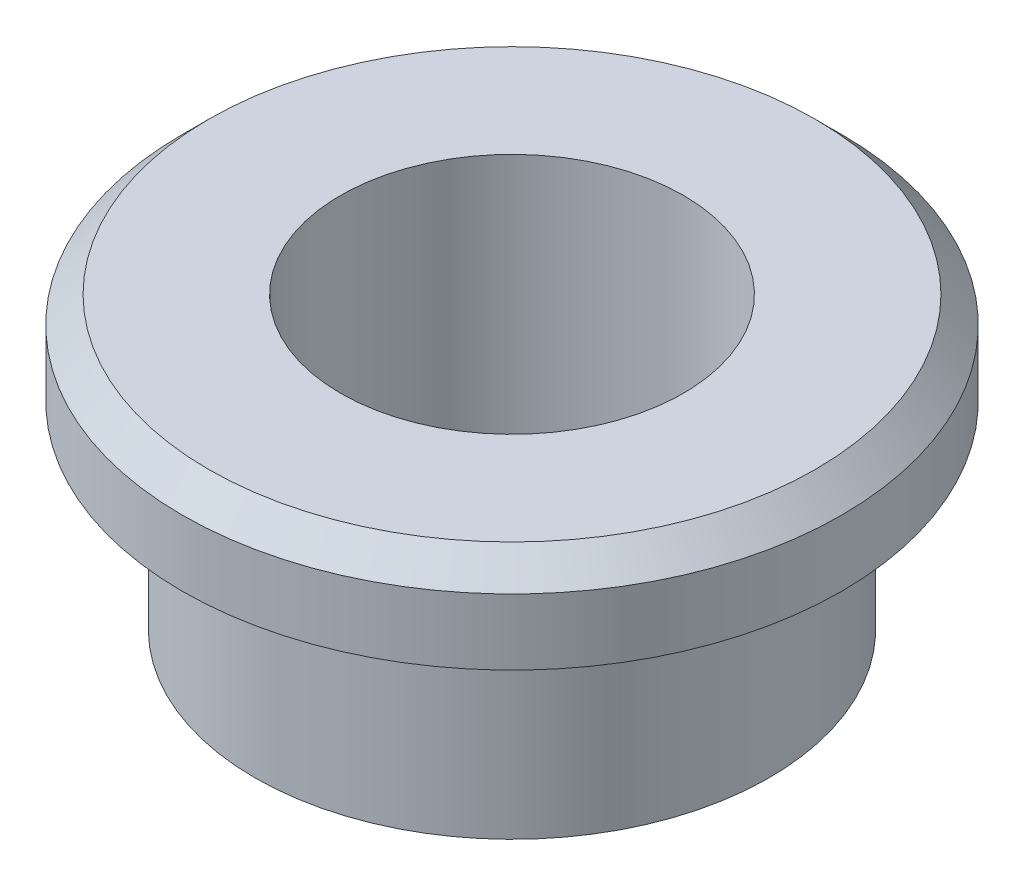
ISO-10303-21;
HEADER;
FILE_DESCRIPTION(('STEP AP214'),'2;1');
FILE_NAME('part.step','',(''),(''),'','','');
FILE_SCHEMA(('AUTOMOTIVE_DESIGN { 1 0 10303 214 1 1 1 1 }'));
ENDSEC;
DATA;
#1=APPLICATION_CONTEXT('core data for automotive mechanical design processes');
#2=APPLICATION_PROTOCOL_DEFINITION('international standard','automotive_design',2000,#1);
#3=PRODUCT_CONTEXT('',#1,'mechanical');
#4=PRODUCT('Part','Part','',(#3));
#5=PRODUCT_RELATED_PRODUCT_CATEGORY('part','',(#4));
#6=PRODUCT_DEFINITION_FORMATION('','',#4);
#7=PRODUCT_DEFINITION_CONTEXT('part definition',#1,'design');
#8=PRODUCT_DEFINITION('design','',#6,#7);
#9=PRODUCT_DEFINITION_SHAPE('','',#8);
#10=(LENGTH_UNIT() NAMED_UNIT(*) SI_UNIT(.MILLI.,.METRE.));
#11=(NAMED_UNIT(*) PLANE_ANGLE_UNIT() SI_UNIT($,.RADIAN.));
#12=(NAMED_UNIT(*) SI_UNIT($,.STERADIAN.) SOLID_ANGLE_UNIT());
#13=UNCERTAINTY_MEASURE_WITH_UNIT(LENGTH_MEASURE(1.E-05),#10,'distance_accuracy_value','');
#14=(GEOMETRIC_REPRESENTATION_CONTEXT(3) GLOBAL_UNCERTAINTY_ASSIGNED_CONTEXT((#13)) GLOBAL_UNIT_ASSIGNED_CONTEXT((#10,
#11,#12)) REPRESENTATION_CONTEXT('',''));
#15=CARTESIAN_POINT('',(0.,0.,0.));
#16=DIRECTION('',(0.,0.,1.));
#17=DIRECTION('',(1.,0.,0.));
#18=AXIS2_PLACEMENT_3D('',#15,#16,#17);
#19=CARTESIAN_POINT('',(2.6,0.,0.));
#20=DIRECTION('',(0.,1.,0.));
#21=DIRECTION('',(0.,0.,1.));
#22=AXIS2_PLACEMENT_3D('',#19,#20,#21);
#23=PLANE('',#22);
#24=CARTESIAN_POINT('',(0.,0.,0.));
#25=DIRECTION('',(0.,1.,0.));
#26=DIRECTION('',(0.,0.,1.));
#27=AXIS2_PLACEMENT_3D('',#24,#25,#26);
#28=CIRCLE('',#27,3.9);
#29=CARTESIAN_POINT('',(0.,0.,3.9));
#30=VERTEX_POINT('',#29);
#31=EDGE_CURVE('E10',#30,#30,#28,.T.);
#32=ORIENTED_EDGE('',*,*,#31,.F.);
#33=EDGE_LOOP('',(#32));
#34=FACE_BOUND('',#33,.T.);
#35=CARTESIAN_POINT('',(0.,0.,0.));
#36=DIRECTION('',(0.,1.,0.));
#37=DIRECTION('',(0.,0.,1.));
#38=AXIS2_PLACEMENT_3D('',#35,#36,#37);
#39=CIRCLE('',#38,2.6);
#40=CARTESIAN_POINT('',(0.,0.,2.6));
#41=VERTEX_POINT('',#40);
#42=EDGE_CURVE('E55',#41,#41,#39,.T.);
#43=ORIENTED_EDGE('',*,*,#42,.T.);
#44=EDGE_LOOP('',(#43));
#45=FACE_BOUND('',#44,.T.);
#46=ADVANCED_FACE('F30',(#34,#45),#23,.F.);
#47=CARTESIAN_POINT('',(0.,9.79114795561097,0.));
#48=DIRECTION('',(0.,1.,0.));
#49=DIRECTION('',(0.,0.,1.));
#50=AXIS2_PLACEMENT_3D('',#47,#48,#49);
#51=CYLINDRICAL_SURFACE('',#50,3.9);
#52=CARTESIAN_POINT('',(0.,3.,0.));
#53=DIRECTION('',(0.,1.,0.));
#54=DIRECTION('',(0.,0.,1.));
#55=AXIS2_PLACEMENT_3D('',#52,#53,#54);
#56=CIRCLE('',#55,3.9);
#57=CARTESIAN_POINT('',(0.,3.,3.9));
#58=VERTEX_POINT('',#57);
#59=EDGE_CURVE('E36',#58,#58,#56,.T.);
#60=ORIENTED_EDGE('',*,*,#59,.F.);
#61=EDGE_LOOP('',(#60));
#62=FACE_BOUND('',#61,.T.);
#63=ORIENTED_EDGE('',*,*,#31,.T.);
#64=EDGE_LOOP('',(#63));
#65=FACE_BOUND('',#64,.T.);
#66=ADVANCED_FACE('F86',(#62,#65),#51,.T.);
#67=CARTESIAN_POINT('',(3.9,3.,0.));
#68=DIRECTION('',(0.,1.,0.));
#69=DIRECTION('',(0.,0.,1.));
#70=AXIS2_PLACEMENT_3D('',#67,#68,#69);
#71=PLANE('',#70);
#72=CARTESIAN_POINT('',(0.,3.,0.));
#73=DIRECTION('',(0.,1.,0.));
#74=DIRECTION('',(0.,0.,1.));
#75=AXIS2_PLACEMENT_3D('',#72,#73,#74);
#76=CIRCLE('',#75,5.);
#77=CARTESIAN_POINT('',(0.,3.,5.));
#78=VERTEX_POINT('',#77);
#79=EDGE_CURVE('E40',#78,#78,#76,.T.);
#80=ORIENTED_EDGE('',*,*,#79,.F.);
#81=EDGE_LOOP('',(#80));
#82=FACE_BOUND('',#81,.T.);
#83=ORIENTED_EDGE('',*,*,#59,.T.);
#84=EDGE_LOOP('',(#83));
#85=FACE_BOUND('',#84,.T.);
#86=ADVANCED_FACE('F81',(#82,#85),#71,.F.);
#87=CARTESIAN_POINT('',(0.,9.79114795561097,0.));
#88=DIRECTION('',(0.,1.,0.));
#89=DIRECTION('',(0.,0.,1.));
#90=AXIS2_PLACEMENT_3D('',#87,#88,#89);
#91=CYLINDRICAL_SURFACE('',#90,5.);
#92=CARTESIAN_POINT('',(0.,4.,0.));
#93=DIRECTION('',(0.,1.,0.));
#94=DIRECTION('',(0.,0.,1.));
#95=AXIS2_PLACEMENT_3D('',#92,#93,#94);
#96=CIRCLE('',#95,5.);
#97=CARTESIAN_POINT('',(0.,4.,5.));
#98=VERTEX_POINT('',#97);
#99=EDGE_CURVE('E44',#98,#98,#96,.T.);
#100=ORIENTED_EDGE('',*,*,#99,.F.);
#101=EDGE_LOOP('',(#100));
#102=FACE_BOUND('',#101,.T.);
#103=ORIENTED_EDGE('',*,*,#79,.T.);
#104=EDGE_LOOP('',(#103));
#105=FACE_BOUND('',#104,.T.);
#106=ADVANCED_FACE('F75',(#102,#105),#91,.T.);
#107=CARTESIAN_POINT('',(0.,4.,0.));
#108=DIRECTION('',(0.,-1.,0.));
#109=DIRECTION('',(0.,0.,-1.));
#110=AXIS2_PLACEMENT_3D('',#107,#108,#109);
#111=CONICAL_SURFACE('',#110,5.,0.785398163397448);
#112=CARTESIAN_POINT('',(0.,4.4,0.));
#113=DIRECTION('',(0.,1.,0.));
#114=DIRECTION('',(0.,0.,1.));
#115=AXIS2_PLACEMENT_3D('',#112,#113,#114);
#116=CIRCLE('',#115,4.6);
#117=CARTESIAN_POINT('',(0.,4.4,4.6));
#118=VERTEX_POINT('',#117);
#119=EDGE_CURVE('E49',#118,#118,#116,.T.);
#120=ORIENTED_EDGE('',*,*,#119,.F.);
#121=EDGE_LOOP('',(#120));
#122=FACE_BOUND('',#121,.T.);
#123=ORIENTED_EDGE('',*,*,#99,.T.);
#124=EDGE_LOOP('',(#123));
#125=FACE_BOUND('',#124,.T.);
#126=ADVANCED_FACE('F69',(#122,#125),#111,.T.);
#127=CARTESIAN_POINT('',(4.6,4.4,0.));
#128=DIRECTION('',(0.,-1.,0.));
#129=DIRECTION('',(0.,0.,-1.));
#130=AXIS2_PLACEMENT_3D('',#127,#128,#129);
#131=PLANE('',#130);
#132=CARTESIAN_POINT('',(0.,4.4,0.));
#133=DIRECTION('',(0.,1.,0.));
#134=DIRECTION('',(0.,0.,1.));
#135=AXIS2_PLACEMENT_3D('',#132,#133,#134);
#136=CIRCLE('',#135,2.6);
#137=CARTESIAN_POINT('',(0.,4.4,2.6));
#138=VERTEX_POINT('',#137);
#139=EDGE_CURVE('E52',#138,#138,#136,.T.);
#140=ORIENTED_EDGE('',*,*,#139,.F.);
#141=EDGE_LOOP('',(#140));
#142=FACE_BOUND('',#141,.T.);
#143=ORIENTED_EDGE('',*,*,#119,.T.);
#144=EDGE_LOOP('',(#143));
#145=FACE_BOUND('',#144,.T.);
#146=ADVANCED_FACE('F63',(#142,#145),#131,.F.);
#147=CARTESIAN_POINT('',(0.,9.79114795561097,0.));
#148=DIRECTION('',(0.,1.,0.));
#149=DIRECTION('',(0.,0.,1.));
#150=AXIS2_PLACEMENT_3D('',#147,#148,#149);
#151=CYLINDRICAL_SURFACE('',#150,2.6);
#152=ORIENTED_EDGE('',*,*,#42,.F.);
#153=EDGE_LOOP('',(#152));
#154=FACE_BOUND('',#153,.T.);
#155=ORIENTED_EDGE('',*,*,#139,.T.);
#156=EDGE_LOOP('',(#155));
#157=FACE_BOUND('',#156,.T.);
#158=ADVANCED_FACE('F60',(#154,#157),#151,.F.);
#159=CLOSED_SHELL('',(#46,#66,#86,#106,#126,#146,#158));
#160=MANIFOLD_SOLID_BREP('B2',#159);
#161=ADVANCED_BREP_SHAPE_REPRESENTATION('',(#18,#160),#14);
#162=SHAPE_DEFINITION_REPRESENTATION(#9,#161);
ENDSEC;
END-ISO-10303-21;
